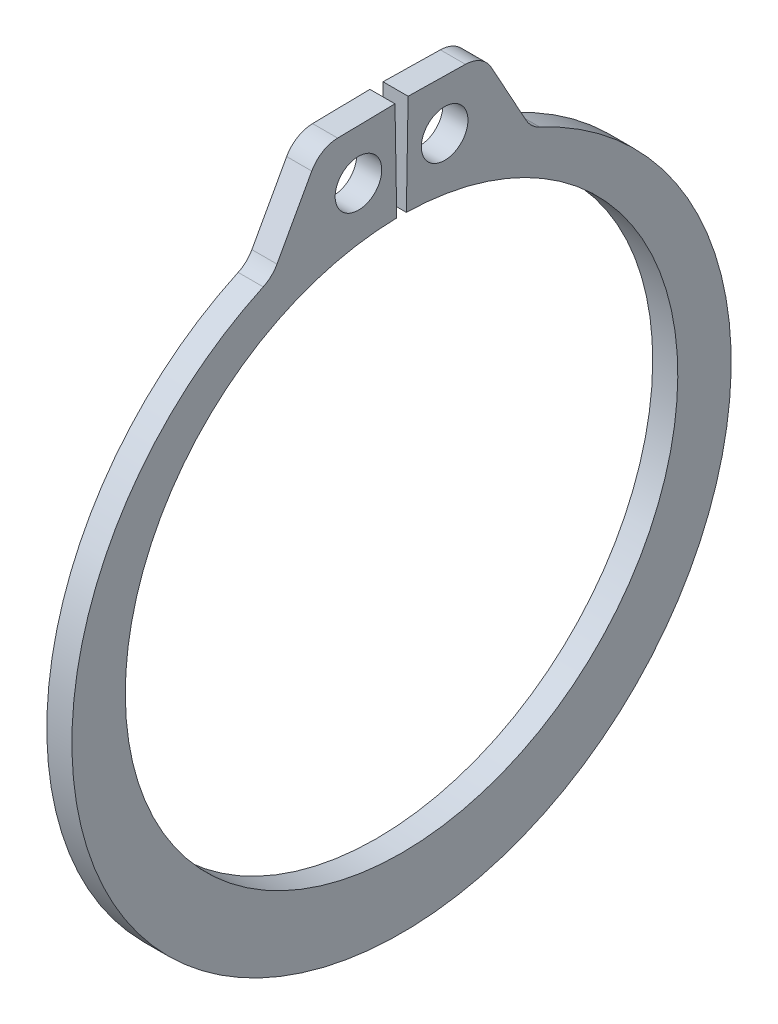
ISO-10303-21;
HEADER;
FILE_DESCRIPTION(('STEP AP214'),'2;1');
FILE_NAME('part.step','',(''),(''),'','','');
FILE_SCHEMA(('AUTOMOTIVE_DESIGN { 1 0 10303 214 1 1 1 1 }'));
ENDSEC;
DATA;
#1=APPLICATION_CONTEXT('core data for automotive mechanical design processes');
#2=APPLICATION_PROTOCOL_DEFINITION('international standard','automotive_design',2000,#1);
#3=PRODUCT_CONTEXT('',#1,'mechanical');
#4=PRODUCT('Part','Part','',(#3));
#5=PRODUCT_RELATED_PRODUCT_CATEGORY('part','',(#4));
#6=PRODUCT_DEFINITION_FORMATION('','',#4);
#7=PRODUCT_DEFINITION_CONTEXT('part definition',#1,'design');
#8=PRODUCT_DEFINITION('design','',#6,#7);
#9=PRODUCT_DEFINITION_SHAPE('','',#8);
#10=(LENGTH_UNIT() NAMED_UNIT(*) SI_UNIT(.MILLI.,.METRE.));
#11=(NAMED_UNIT(*) PLANE_ANGLE_UNIT() SI_UNIT($,.RADIAN.));
#12=(NAMED_UNIT(*) SI_UNIT($,.STERADIAN.) SOLID_ANGLE_UNIT());
#13=UNCERTAINTY_MEASURE_WITH_UNIT(LENGTH_MEASURE(1.E-05),#10,'distance_accuracy_value','');
#14=(GEOMETRIC_REPRESENTATION_CONTEXT(3) GLOBAL_UNCERTAINTY_ASSIGNED_CONTEXT((#13)) GLOBAL_UNIT_ASSIGNED_CONTEXT((#10,
#11,#12)) REPRESENTATION_CONTEXT('',''));
#15=CARTESIAN_POINT('',(0.,0.,0.));
#16=DIRECTION('',(0.,0.,1.));
#17=DIRECTION('',(1.,0.,0.));
#18=AXIS2_PLACEMENT_3D('',#15,#16,#17);
#19=CARTESIAN_POINT('',(0.5334,0.,0.));
#20=DIRECTION('',(1.,0.,0.));
#21=DIRECTION('',(0.,0.,-1.));
#22=AXIS2_PLACEMENT_3D('',#19,#20,#21);
#23=PLANE('',#22);
#24=CARTESIAN_POINT('',(0.5334,13.8385266688972,1.8324696859277));
#25=DIRECTION('',(1.,0.,0.));
#26=DIRECTION('',(0.,0.,-1.));
#27=AXIS2_PLACEMENT_3D('',#24,#25,#26);
#28=CIRCLE('',#27,0.9906);
#29=CARTESIAN_POINT('',(0.5334,13.8385266688972,0.841869685927701));
#30=VERTEX_POINT('',#29);
#31=EDGE_CURVE('E218',#30,#30,#28,.T.);
#32=ORIENTED_EDGE('',*,*,#31,.F.);
#33=EDGE_LOOP('',(#32));
#34=FACE_BOUND('',#33,.T.);
#35=DIRECTION('',(0.,-0.0174524064372829,0.999847695156391));
#36=VECTOR('',#35,1.);
#37=CARTESIAN_POINT('',(0.5334,15.9868647521641,0.279051762247657));
#38=LINE('',#37,#36);
#39=CARTESIAN_POINT('',(0.5334,15.9868647521641,0.279051762247657));
#40=VERTEX_POINT('',#39);
#41=CARTESIAN_POINT('',(0.5334,15.9443119802331,2.71689843345609));
#42=VERTEX_POINT('',#41);
#43=EDGE_CURVE('E130',#40,#42,#38,.T.);
#44=ORIENTED_EDGE('',*,*,#43,.T.);
#45=CARTESIAN_POINT('',(0.5334,14.661807341656,2.69451223171899));
#46=DIRECTION('',(1.,0.,0.));
#47=DIRECTION('',(0.,0.,-1.));
#48=AXIS2_PLACEMENT_3D('',#45,#46,#47);
#49=CIRCLE('',#48,1.2827);
#50=CARTESIAN_POINT('',(0.5334,15.2803079489985,3.81824542457083));
#51=VERTEX_POINT('',#50);
#52=EDGE_CURVE('E171',#42,#51,#49,.T.);
#53=ORIENTED_EDGE('',*,*,#52,.T.);
#54=DIRECTION('',(0.,-0.876068599712977,0.482186487364529));
#55=VECTOR('',#54,1.);
#56=CARTESIAN_POINT('',(0.5334,15.9313425389448,3.45991722723344));
#57=LINE('',#56,#55);
#58=CARTESIAN_POINT('',(0.5334,12.5932417303443,5.29720154936886));
#59=VERTEX_POINT('',#58);
#60=EDGE_CURVE('E210',#51,#59,#57,.T.);
#61=ORIENTED_EDGE('',*,*,#60,.T.);
#62=CARTESIAN_POINT('',(0.5334,13.2117423376868,6.4209347422207));
#63=DIRECTION('',(1.,0.,0.));
#64=DIRECTION('',(0.,0.,-1.));
#65=AXIS2_PLACEMENT_3D('',#62,#63,#64);
#66=CIRCLE('',#65,1.2827);
#67=CARTESIAN_POINT('',(0.5334,12.0474579195929,5.88264013535209));
#68=VERTEX_POINT('',#67);
#69=EDGE_CURVE('E178',#59,#68,#66,.F.);
#70=ORIENTED_EDGE('',*,*,#69,.T.);
#71=CARTESIAN_POINT('',(0.5334,-0.676181068147741,0.));
#72=DIRECTION('',(1.,0.,0.));
#73=DIRECTION('',(0.,0.,-1.));
#74=AXIS2_PLACEMENT_3D('',#71,#72,#73);
#75=CIRCLE('',#74,14.0177189318523);
#76=CARTESIAN_POINT('',(0.5334,12.0474579195929,-5.88264013535209));
#77=VERTEX_POINT('',#76);
#78=EDGE_CURVE('E203',#68,#77,#75,.T.);
#79=ORIENTED_EDGE('',*,*,#78,.T.);
#80=CARTESIAN_POINT('',(0.5334,13.2117423376868,-6.4209347422207));
#81=DIRECTION('',(1.,0.,0.));
#82=DIRECTION('',(0.,0.,-1.));
#83=AXIS2_PLACEMENT_3D('',#80,#81,#82);
#84=CIRCLE('',#83,1.2827);
#85=CARTESIAN_POINT('',(0.5334,12.5932417303443,-5.29720154936886));
#86=VERTEX_POINT('',#85);
#87=EDGE_CURVE('E11',#77,#86,#84,.F.);
#88=ORIENTED_EDGE('',*,*,#87,.T.);
#89=DIRECTION('',(0.,0.876068599712977,0.482186487364529));
#90=VECTOR('',#89,1.);
#91=CARTESIAN_POINT('',(0.5334,15.9313425389448,-3.45991722723344));
#92=LINE('',#91,#90);
#93=CARTESIAN_POINT('',(0.5334,15.2803079489985,-3.81824542457083));
#94=VERTEX_POINT('',#93);
#95=EDGE_CURVE('E202',#86,#94,#92,.T.);
#96=ORIENTED_EDGE('',*,*,#95,.T.);
#97=CARTESIAN_POINT('',(0.5334,14.661807341656,-2.69451223171899));
#98=DIRECTION('',(1.,0.,0.));
#99=DIRECTION('',(0.,0.,-1.));
#100=AXIS2_PLACEMENT_3D('',#97,#98,#99);
#101=CIRCLE('',#100,1.2827);
#102=CARTESIAN_POINT('',(0.5334,15.9443119802331,-2.71689843345609));
#103=VERTEX_POINT('',#102);
#104=EDGE_CURVE('E46',#94,#103,#101,.T.);
#105=ORIENTED_EDGE('',*,*,#104,.T.);
#106=DIRECTION('',(0.,0.0174524064372829,0.999847695156391));
#107=VECTOR('',#106,1.);
#108=CARTESIAN_POINT('',(0.5334,15.9868647521641,-0.279051762247657));
#109=LINE('',#108,#107);
#110=CARTESIAN_POINT('',(0.5334,15.9868647521641,-0.279051762247657));
#111=VERTEX_POINT('',#110);
#112=EDGE_CURVE('E207',#103,#111,#109,.T.);
#113=ORIENTED_EDGE('',*,*,#112,.T.);
#114=DIRECTION('',(0.,-0.999847695156391,0.0174524064372834));
#115=VECTOR('',#114,1.);
#116=CARTESIAN_POINT('',(0.5334,11.7457107988497,-0.205022144621988));
#117=LINE('',#116,#115);
#118=CARTESIAN_POINT('',(0.5334,11.7457107988497,-0.205022144621988));
#119=VERTEX_POINT('',#118);
#120=EDGE_CURVE('E136',#111,#119,#117,.T.);
#121=ORIENTED_EDGE('',*,*,#120,.T.);
#122=CARTESIAN_POINT('',(0.5334,0.,0.));
#123=DIRECTION('',(-1.,0.,0.));
#124=DIRECTION('',(0.,0.,-1.));
#125=AXIS2_PLACEMENT_3D('',#122,#123,#124);
#126=CIRCLE('',#125,11.7475);
#127=CARTESIAN_POINT('',(0.5334,11.7457107988497,0.205022144621988));
#128=VERTEX_POINT('',#127);
#129=EDGE_CURVE('E131',#119,#128,#126,.T.);
#130=ORIENTED_EDGE('',*,*,#129,.T.);
#131=DIRECTION('',(0.,0.999847695156391,0.0174524064372834));
#132=VECTOR('',#131,1.);
#133=CARTESIAN_POINT('',(0.5334,11.7457107988497,0.205022144621988));
#134=LINE('',#133,#132);
#135=EDGE_CURVE('E122',#128,#40,#134,.T.);
#136=ORIENTED_EDGE('',*,*,#135,.T.);
#137=EDGE_LOOP('',(#44,#53,#61,#70,#79,#88,#96,#105,#113,#121,#130,#136));
#138=FACE_BOUND('',#137,.T.);
#139=CARTESIAN_POINT('',(0.5334,13.8385266688972,-1.8324696859277));
#140=DIRECTION('',(1.,0.,0.));
#141=DIRECTION('',(0.,0.,-1.));
#142=AXIS2_PLACEMENT_3D('',#139,#140,#141);
#143=CIRCLE('',#142,0.9906);
#144=CARTESIAN_POINT('',(0.5334,13.8385266688972,-2.8230696859277));
#145=VERTEX_POINT('',#144);
#146=EDGE_CURVE('E244',#145,#145,#143,.T.);
#147=ORIENTED_EDGE('',*,*,#146,.F.);
#148=EDGE_LOOP('',(#147));
#149=FACE_BOUND('',#148,.T.);
#150=ADVANCED_FACE('F31',(#34,#138,#149),#23,.T.);
#151=CARTESIAN_POINT('',(-0.5334,0.,0.));
#152=DIRECTION('',(1.,0.,0.));
#153=DIRECTION('',(0.,0.,-1.));
#154=AXIS2_PLACEMENT_3D('',#151,#152,#153);
#155=PLANE('',#154);
#156=CARTESIAN_POINT('',(-0.5334,13.8385266688972,1.8324696859277));
#157=DIRECTION('',(1.,0.,0.));
#158=DIRECTION('',(0.,0.,-1.));
#159=AXIS2_PLACEMENT_3D('',#156,#157,#158);
#160=CIRCLE('',#159,0.9906);
#161=CARTESIAN_POINT('',(-0.5334,13.8385266688972,0.841869685927701));
#162=VERTEX_POINT('',#161);
#163=EDGE_CURVE('E241',#162,#162,#160,.T.);
#164=ORIENTED_EDGE('',*,*,#163,.T.);
#165=EDGE_LOOP('',(#164));
#166=FACE_BOUND('',#165,.T.);
#167=DIRECTION('',(0.,-0.876068599712977,0.482186487364529));
#168=VECTOR('',#167,1.);
#169=CARTESIAN_POINT('',(-0.5334,15.9313425389448,3.45991722723344));
#170=LINE('',#169,#168);
#171=CARTESIAN_POINT('',(-0.5334,15.2803079489985,3.81824542457083));
#172=VERTEX_POINT('',#171);
#173=CARTESIAN_POINT('',(-0.5334,12.5932417303443,5.29720154936886));
#174=VERTEX_POINT('',#173);
#175=EDGE_CURVE('E197',#172,#174,#170,.T.);
#176=ORIENTED_EDGE('',*,*,#175,.F.);
#177=CARTESIAN_POINT('',(-0.5334,14.661807341656,2.69451223171899));
#178=DIRECTION('',(1.,0.,0.));
#179=DIRECTION('',(0.,0.,-1.));
#180=AXIS2_PLACEMENT_3D('',#177,#178,#179);
#181=CIRCLE('',#180,1.2827);
#182=CARTESIAN_POINT('',(-0.5334,15.9443119802331,2.71689843345609));
#183=VERTEX_POINT('',#182);
#184=EDGE_CURVE('E167',#172,#183,#181,.F.);
#185=ORIENTED_EDGE('',*,*,#184,.T.);
#186=DIRECTION('',(0.,-0.0174524064372829,0.999847695156391));
#187=VECTOR('',#186,1.);
#188=CARTESIAN_POINT('',(-0.5334,15.9868647521641,0.279051762247657));
#189=LINE('',#188,#187);
#190=CARTESIAN_POINT('',(-0.5334,15.9868647521641,0.279051762247657));
#191=VERTEX_POINT('',#190);
#192=EDGE_CURVE('E220',#191,#183,#189,.T.);
#193=ORIENTED_EDGE('',*,*,#192,.F.);
#194=DIRECTION('',(0.,0.999847695156391,0.0174524064372834));
#195=VECTOR('',#194,1.);
#196=CARTESIAN_POINT('',(-0.5334,11.7457107988497,0.205022144621988));
#197=LINE('',#196,#195);
#198=CARTESIAN_POINT('',(-0.5334,11.7457107988497,0.205022144621988));
#199=VERTEX_POINT('',#198);
#200=EDGE_CURVE('E217',#199,#191,#197,.T.);
#201=ORIENTED_EDGE('',*,*,#200,.F.);
#202=CARTESIAN_POINT('',(-0.5334,0.,0.));
#203=DIRECTION('',(-1.,0.,0.));
#204=DIRECTION('',(0.,0.,-1.));
#205=AXIS2_PLACEMENT_3D('',#202,#203,#204);
#206=CIRCLE('',#205,11.7475);
#207=CARTESIAN_POINT('',(-0.5334,11.7457107988497,-0.205022144621988));
#208=VERTEX_POINT('',#207);
#209=EDGE_CURVE('E144',#208,#199,#206,.T.);
#210=ORIENTED_EDGE('',*,*,#209,.F.);
#211=DIRECTION('',(0.,-0.999847695156391,0.0174524064372834));
#212=VECTOR('',#211,1.);
#213=CARTESIAN_POINT('',(-0.5334,11.7457107988497,-0.205022144621988));
#214=LINE('',#213,#212);
#215=CARTESIAN_POINT('',(-0.5334,15.9868647521641,-0.279051762247657));
#216=VERTEX_POINT('',#215);
#217=EDGE_CURVE('E140',#216,#208,#214,.T.);
#218=ORIENTED_EDGE('',*,*,#217,.F.);
#219=DIRECTION('',(0.,0.0174524064372829,0.999847695156391));
#220=VECTOR('',#219,1.);
#221=CARTESIAN_POINT('',(-0.5334,15.9868647521641,-0.279051762247657));
#222=LINE('',#221,#220);
#223=CARTESIAN_POINT('',(-0.5334,15.9443119802331,-2.71689843345609));
#224=VERTEX_POINT('',#223);
#225=EDGE_CURVE('E225',#224,#216,#222,.T.);
#226=ORIENTED_EDGE('',*,*,#225,.F.);
#227=CARTESIAN_POINT('',(-0.5334,14.661807341656,-2.69451223171899));
#228=DIRECTION('',(1.,0.,0.));
#229=DIRECTION('',(0.,0.,-1.));
#230=AXIS2_PLACEMENT_3D('',#227,#228,#229);
#231=CIRCLE('',#230,1.2827);
#232=CARTESIAN_POINT('',(-0.5334,15.2803079489985,-3.81824542457083));
#233=VERTEX_POINT('',#232);
#234=EDGE_CURVE('E165',#224,#233,#231,.F.);
#235=ORIENTED_EDGE('',*,*,#234,.T.);
#236=DIRECTION('',(0.,0.876068599712977,0.482186487364529));
#237=VECTOR('',#236,1.);
#238=CARTESIAN_POINT('',(-0.5334,15.9313425389448,-3.45991722723344));
#239=LINE('',#238,#237);
#240=CARTESIAN_POINT('',(-0.5334,12.5932417303443,-5.29720154936886));
#241=VERTEX_POINT('',#240);
#242=EDGE_CURVE('E188',#241,#233,#239,.T.);
#243=ORIENTED_EDGE('',*,*,#242,.F.);
#244=CARTESIAN_POINT('',(-0.5334,13.2117423376868,-6.4209347422207));
#245=DIRECTION('',(1.,0.,0.));
#246=DIRECTION('',(0.,0.,-1.));
#247=AXIS2_PLACEMENT_3D('',#244,#245,#246);
#248=CIRCLE('',#247,1.2827);
#249=CARTESIAN_POINT('',(-0.5334,12.0474579195929,-5.88264013535209));
#250=VERTEX_POINT('',#249);
#251=EDGE_CURVE('E39',#241,#250,#248,.T.);
#252=ORIENTED_EDGE('',*,*,#251,.T.);
#253=CARTESIAN_POINT('',(-0.5334,-0.676181068147741,0.));
#254=DIRECTION('',(1.,0.,0.));
#255=DIRECTION('',(0.,0.,-1.));
#256=AXIS2_PLACEMENT_3D('',#253,#254,#255);
#257=CIRCLE('',#256,14.0177189318523);
#258=CARTESIAN_POINT('',(-0.5334,12.0474579195929,5.88264013535209));
#259=VERTEX_POINT('',#258);
#260=EDGE_CURVE('E186',#259,#250,#257,.T.);
#261=ORIENTED_EDGE('',*,*,#260,.F.);
#262=CARTESIAN_POINT('',(-0.5334,13.2117423376868,6.4209347422207));
#263=DIRECTION('',(1.,0.,0.));
#264=DIRECTION('',(0.,0.,-1.));
#265=AXIS2_PLACEMENT_3D('',#262,#263,#264);
#266=CIRCLE('',#265,1.2827);
#267=EDGE_CURVE('E176',#259,#174,#266,.T.);
#268=ORIENTED_EDGE('',*,*,#267,.T.);
#269=EDGE_LOOP('',(#176,#185,#193,#201,#210,#218,#226,#235,#243,#252,#261,#268));
#270=FACE_BOUND('',#269,.T.);
#271=CARTESIAN_POINT('',(-0.5334,13.8385266688972,-1.8324696859277));
#272=DIRECTION('',(1.,0.,0.));
#273=DIRECTION('',(0.,0.,-1.));
#274=AXIS2_PLACEMENT_3D('',#271,#272,#273);
#275=CIRCLE('',#274,0.9906);
#276=CARTESIAN_POINT('',(-0.5334,13.8385266688972,-2.8230696859277));
#277=VERTEX_POINT('',#276);
#278=EDGE_CURVE('E247',#277,#277,#275,.T.);
#279=ORIENTED_EDGE('',*,*,#278,.T.);
#280=EDGE_LOOP('',(#279));
#281=FACE_BOUND('',#280,.T.);
#282=ADVANCED_FACE('F184',(#166,#270,#281),#155,.F.);
#283=CARTESIAN_POINT('',(0.5334,0.,0.));
#284=DIRECTION('',(-1.,0.,0.));
#285=DIRECTION('',(0.,0.,1.));
#286=AXIS2_PLACEMENT_3D('',#283,#284,#285);
#287=CYLINDRICAL_SURFACE('',#286,11.7475);
#288=ORIENTED_EDGE('',*,*,#209,.T.);
#289=DIRECTION('',(-1.,0.,0.));
#290=VECTOR('',#289,1.);
#291=CARTESIAN_POINT('',(0.5334,11.7457107988497,0.205022144621988));
#292=LINE('',#291,#290);
#293=EDGE_CURVE('E126',#128,#199,#292,.T.);
#294=ORIENTED_EDGE('',*,*,#293,.F.);
#295=ORIENTED_EDGE('',*,*,#129,.F.);
#296=DIRECTION('',(-1.,0.,0.));
#297=VECTOR('',#296,1.);
#298=CARTESIAN_POINT('',(0.5334,11.7457107988497,-0.205022144621988));
#299=LINE('',#298,#297);
#300=EDGE_CURVE('E215',#119,#208,#299,.T.);
#301=ORIENTED_EDGE('',*,*,#300,.T.);
#302=EDGE_LOOP('',(#288,#294,#295,#301));
#303=FACE_BOUND('',#302,.T.);
#304=ADVANCED_FACE('F142',(#303),#287,.F.);
#305=CARTESIAN_POINT('',(0.5334,11.7457107988497,0.205022144621988));
#306=DIRECTION('',(0.,-0.0174524064372834,0.999847695156391));
#307=DIRECTION('',(0.,-0.999847695156391,-0.0174524064372834));
#308=AXIS2_PLACEMENT_3D('',#305,#306,#307);
#309=PLANE('',#308);
#310=ORIENTED_EDGE('',*,*,#200,.T.);
#311=DIRECTION('',(-1.,0.,0.));
#312=VECTOR('',#311,1.);
#313=CARTESIAN_POINT('',(0.5334,15.9868647521641,0.279051762247657));
#314=LINE('',#313,#312);
#315=EDGE_CURVE('E129',#40,#191,#314,.T.);
#316=ORIENTED_EDGE('',*,*,#315,.F.);
#317=ORIENTED_EDGE('',*,*,#135,.F.);
#318=ORIENTED_EDGE('',*,*,#293,.T.);
#319=EDGE_LOOP('',(#310,#316,#317,#318));
#320=FACE_BOUND('',#319,.T.);
#321=ADVANCED_FACE('F124',(#320),#309,.F.);
#322=CARTESIAN_POINT('',(0.5334,15.9868647521641,0.279051762247657));
#323=DIRECTION('',(0.,-0.999847695156391,-0.0174524064372829));
#324=DIRECTION('',(0.,0.0174524064372829,-0.999847695156391));
#325=AXIS2_PLACEMENT_3D('',#322,#323,#324);
#326=PLANE('',#325);
#327=ORIENTED_EDGE('',*,*,#192,.T.);
#328=DIRECTION('',(-1.,0.,0.));
#329=VECTOR('',#328,1.);
#330=CARTESIAN_POINT('',(0.5334,15.9443119802331,2.71689843345609));
#331=LINE('',#330,#329);
#332=EDGE_CURVE('E54',#183,#42,#331,.F.);
#333=ORIENTED_EDGE('',*,*,#332,.T.);
#334=ORIENTED_EDGE('',*,*,#43,.F.);
#335=ORIENTED_EDGE('',*,*,#315,.T.);
#336=EDGE_LOOP('',(#327,#333,#334,#335));
#337=FACE_BOUND('',#336,.T.);
#338=ADVANCED_FACE('F236',(#337),#326,.F.);
#339=CARTESIAN_POINT('',(0.5334,15.9313425389448,3.45991722723344));
#340=DIRECTION('',(0.,-0.482186487364529,-0.876068599712977));
#341=DIRECTION('',(0.,0.876068599712977,-0.482186487364529));
#342=AXIS2_PLACEMENT_3D('',#339,#340,#341);
#343=PLANE('',#342);
#344=ORIENTED_EDGE('',*,*,#175,.T.);
#345=DIRECTION('',(1.,0.,0.));
#346=VECTOR('',#345,1.);
#347=CARTESIAN_POINT('',(0.5334,12.5932417303443,5.29720154936886));
#348=LINE('',#347,#346);
#349=EDGE_CURVE('E158',#174,#59,#348,.T.);
#350=ORIENTED_EDGE('',*,*,#349,.T.);
#351=ORIENTED_EDGE('',*,*,#60,.F.);
#352=DIRECTION('',(-1.,0.,0.));
#353=VECTOR('',#352,1.);
#354=CARTESIAN_POINT('',(0.5334,15.2803079489985,3.81824542457083));
#355=LINE('',#354,#353);
#356=EDGE_CURVE('E155',#51,#172,#355,.T.);
#357=ORIENTED_EDGE('',*,*,#356,.T.);
#358=EDGE_LOOP('',(#344,#350,#351,#357));
#359=FACE_BOUND('',#358,.T.);
#360=ADVANCED_FACE('F277',(#359),#343,.F.);
#361=CARTESIAN_POINT('',(0.5334,-0.676181068147741,0.));
#362=DIRECTION('',(-1.,0.,0.));
#363=DIRECTION('',(0.,0.,1.));
#364=AXIS2_PLACEMENT_3D('',#361,#362,#363);
#365=CYLINDRICAL_SURFACE('',#364,14.0177189318523);
#366=ORIENTED_EDGE('',*,*,#78,.F.);
#367=DIRECTION('',(-1.,0.,0.));
#368=VECTOR('',#367,1.);
#369=CARTESIAN_POINT('',(0.5334,12.0474579195929,5.88264013535209));
#370=LINE('',#369,#368);
#371=EDGE_CURVE('E147',#68,#259,#370,.T.);
#372=ORIENTED_EDGE('',*,*,#371,.T.);
#373=ORIENTED_EDGE('',*,*,#260,.T.);
#374=DIRECTION('',(-1.,0.,0.));
#375=VECTOR('',#374,1.);
#376=CARTESIAN_POINT('',(0.5334,12.0474579195929,-5.88264013535209));
#377=LINE('',#376,#375);
#378=EDGE_CURVE('E145',#250,#77,#377,.F.);
#379=ORIENTED_EDGE('',*,*,#378,.T.);
#380=EDGE_LOOP('',(#366,#372,#373,#379));
#381=FACE_BOUND('',#380,.T.);
#382=ADVANCED_FACE('F194',(#381),#365,.T.);
#383=CARTESIAN_POINT('',(0.5334,15.9313425389448,-3.45991722723344));
#384=DIRECTION('',(0.,-0.482186487364529,0.876068599712977));
#385=DIRECTION('',(0.,-0.876068599712977,-0.482186487364529));
#386=AXIS2_PLACEMENT_3D('',#383,#384,#385);
#387=PLANE('',#386);
#388=ORIENTED_EDGE('',*,*,#95,.F.);
#389=DIRECTION('',(1.,0.,0.));
#390=VECTOR('',#389,1.);
#391=CARTESIAN_POINT('',(-0.5334,12.5932417303443,-5.29720154936886));
#392=LINE('',#391,#390);
#393=EDGE_CURVE('E162',#86,#241,#392,.F.);
#394=ORIENTED_EDGE('',*,*,#393,.T.);
#395=ORIENTED_EDGE('',*,*,#242,.T.);
#396=DIRECTION('',(-1.,0.,0.));
#397=VECTOR('',#396,1.);
#398=CARTESIAN_POINT('',(0.5334,15.2803079489985,-3.81824542457083));
#399=LINE('',#398,#397);
#400=EDGE_CURVE('E160',#233,#94,#399,.F.);
#401=ORIENTED_EDGE('',*,*,#400,.T.);
#402=EDGE_LOOP('',(#388,#394,#395,#401));
#403=FACE_BOUND('',#402,.T.);
#404=ADVANCED_FACE('F205',(#403),#387,.F.);
#405=CARTESIAN_POINT('',(0.5334,15.9868647521641,-0.279051762247657));
#406=DIRECTION('',(0.,-0.999847695156391,0.0174524064372829));
#407=DIRECTION('',(0.,-0.0174524064372829,-0.999847695156391));
#408=AXIS2_PLACEMENT_3D('',#405,#406,#407);
#409=PLANE('',#408);
#410=ORIENTED_EDGE('',*,*,#112,.F.);
#411=DIRECTION('',(-1.,0.,0.));
#412=VECTOR('',#411,1.);
#413=CARTESIAN_POINT('',(0.5334,15.9443119802331,-2.71689843345609));
#414=LINE('',#413,#412);
#415=EDGE_CURVE('E173',#103,#224,#414,.T.);
#416=ORIENTED_EDGE('',*,*,#415,.T.);
#417=ORIENTED_EDGE('',*,*,#225,.T.);
#418=DIRECTION('',(-1.,0.,0.));
#419=VECTOR('',#418,1.);
#420=CARTESIAN_POINT('',(0.5334,15.9868647521641,-0.279051762247657));
#421=LINE('',#420,#419);
#422=EDGE_CURVE('E149',#111,#216,#421,.T.);
#423=ORIENTED_EDGE('',*,*,#422,.F.);
#424=EDGE_LOOP('',(#410,#416,#417,#423));
#425=FACE_BOUND('',#424,.T.);
#426=ADVANCED_FACE('F270',(#425),#409,.F.);
#427=CARTESIAN_POINT('',(0.5334,11.7457107988497,-0.205022144621988));
#428=DIRECTION('',(0.,-0.0174524064372834,-0.999847695156391));
#429=DIRECTION('',(0.,0.999847695156391,-0.0174524064372834));
#430=AXIS2_PLACEMENT_3D('',#427,#428,#429);
#431=PLANE('',#430);
#432=ORIENTED_EDGE('',*,*,#217,.T.);
#433=ORIENTED_EDGE('',*,*,#300,.F.);
#434=ORIENTED_EDGE('',*,*,#120,.F.);
#435=ORIENTED_EDGE('',*,*,#422,.T.);
#436=EDGE_LOOP('',(#432,#433,#434,#435));
#437=FACE_BOUND('',#436,.T.);
#438=ADVANCED_FACE('F232',(#437),#431,.F.);
#439=CARTESIAN_POINT('',(0.5334,13.8385266688972,1.8324696859277));
#440=DIRECTION('',(-1.,0.,0.));
#441=DIRECTION('',(0.,0.,1.));
#442=AXIS2_PLACEMENT_3D('',#439,#440,#441);
#443=CYLINDRICAL_SURFACE('',#442,0.9906);
#444=ORIENTED_EDGE('',*,*,#31,.T.);
#445=EDGE_LOOP('',(#444));
#446=FACE_BOUND('',#445,.T.);
#447=ORIENTED_EDGE('',*,*,#163,.F.);
#448=EDGE_LOOP('',(#447));
#449=FACE_BOUND('',#448,.T.);
#450=ADVANCED_FACE('F265',(#446,#449),#443,.F.);
#451=CARTESIAN_POINT('',(0.5334,13.8385266688972,-1.8324696859277));
#452=DIRECTION('',(-1.,0.,0.));
#453=DIRECTION('',(0.,0.,1.));
#454=AXIS2_PLACEMENT_3D('',#451,#452,#453);
#455=CYLINDRICAL_SURFACE('',#454,0.9906);
#456=ORIENTED_EDGE('',*,*,#146,.T.);
#457=EDGE_LOOP('',(#456));
#458=FACE_BOUND('',#457,.T.);
#459=ORIENTED_EDGE('',*,*,#278,.F.);
#460=EDGE_LOOP('',(#459));
#461=FACE_BOUND('',#460,.T.);
#462=ADVANCED_FACE('F253',(#458,#461),#455,.F.);
#463=CARTESIAN_POINT('',(0.5334,13.2117423376868,6.4209347422207));
#464=DIRECTION('',(-1.,0.,0.));
#465=DIRECTION('',(0.,0.,1.));
#466=AXIS2_PLACEMENT_3D('',#463,#464,#465);
#467=CYLINDRICAL_SURFACE('',#466,1.2827);
#468=ORIENTED_EDGE('',*,*,#69,.F.);
#469=ORIENTED_EDGE('',*,*,#349,.F.);
#470=ORIENTED_EDGE('',*,*,#267,.F.);
#471=ORIENTED_EDGE('',*,*,#371,.F.);
#472=EDGE_LOOP('',(#468,#469,#470,#471));
#473=FACE_BOUND('',#472,.T.);
#474=ADVANCED_FACE('F287',(#473),#467,.F.);
#475=CARTESIAN_POINT('',(0.5334,13.2117423376868,-6.4209347422207));
#476=DIRECTION('',(-1.,0.,0.));
#477=DIRECTION('',(0.,0.,1.));
#478=AXIS2_PLACEMENT_3D('',#475,#476,#477);
#479=CYLINDRICAL_SURFACE('',#478,1.2827);
#480=ORIENTED_EDGE('',*,*,#87,.F.);
#481=ORIENTED_EDGE('',*,*,#378,.F.);
#482=ORIENTED_EDGE('',*,*,#251,.F.);
#483=ORIENTED_EDGE('',*,*,#393,.F.);
#484=EDGE_LOOP('',(#480,#481,#482,#483));
#485=FACE_BOUND('',#484,.T.);
#486=ADVANCED_FACE('F200',(#485),#479,.F.);
#487=CARTESIAN_POINT('',(0.5334,14.661807341656,2.69451223171899));
#488=DIRECTION('',(-1.,0.,0.));
#489=DIRECTION('',(0.,0.,1.));
#490=AXIS2_PLACEMENT_3D('',#487,#488,#489);
#491=CYLINDRICAL_SURFACE('',#490,1.2827);
#492=ORIENTED_EDGE('',*,*,#52,.F.);
#493=ORIENTED_EDGE('',*,*,#332,.F.);
#494=ORIENTED_EDGE('',*,*,#184,.F.);
#495=ORIENTED_EDGE('',*,*,#356,.F.);
#496=EDGE_LOOP('',(#492,#493,#494,#495));
#497=FACE_BOUND('',#496,.T.);
#498=ADVANCED_FACE('F292',(#497),#491,.T.);
#499=CARTESIAN_POINT('',(0.5334,14.661807341656,-2.69451223171899));
#500=DIRECTION('',(-1.,0.,0.));
#501=DIRECTION('',(0.,0.,1.));
#502=AXIS2_PLACEMENT_3D('',#499,#500,#501);
#503=CYLINDRICAL_SURFACE('',#502,1.2827);
#504=ORIENTED_EDGE('',*,*,#104,.F.);
#505=ORIENTED_EDGE('',*,*,#400,.F.);
#506=ORIENTED_EDGE('',*,*,#234,.F.);
#507=ORIENTED_EDGE('',*,*,#415,.F.);
#508=EDGE_LOOP('',(#504,#505,#506,#507));
#509=FACE_BOUND('',#508,.T.);
#510=ADVANCED_FACE('F33',(#509),#503,.T.);
#511=CLOSED_SHELL('',(#150,#282,#304,#321,#338,#360,#382,#404,#426,#438,#450,#462,#474,#486,
#498,#510));
#512=MANIFOLD_SOLID_BREP('B2',#511);
#513=ADVANCED_BREP_SHAPE_REPRESENTATION('',(#18,#512),#14);
#514=SHAPE_DEFINITION_REPRESENTATION(#9,#513);
ENDSEC;
END-ISO-10303-21;
